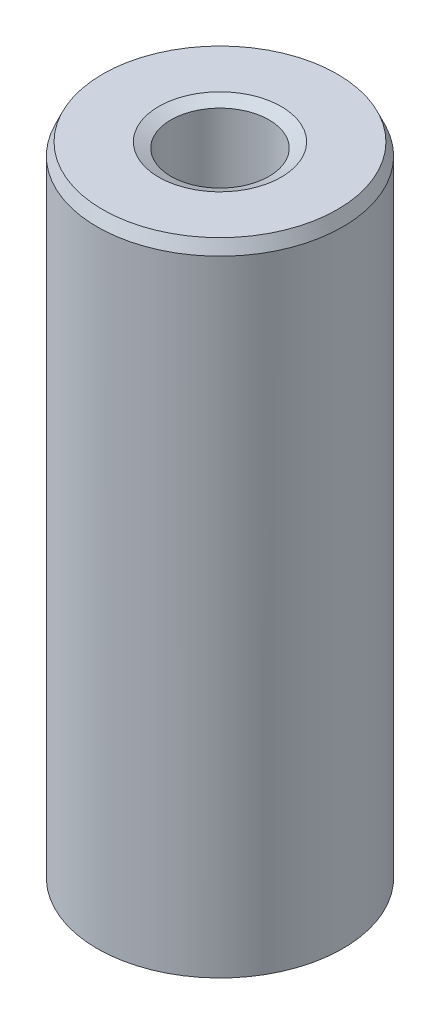
ISO-10303-21;
HEADER;
FILE_DESCRIPTION(('STEP AP214'),'2;1');
FILE_NAME('part.step','',(''),(''),'','','');
FILE_SCHEMA(('AUTOMOTIVE_DESIGN { 1 0 10303 214 1 1 1 1 }'));
ENDSEC;
DATA;
#1=APPLICATION_CONTEXT('core data for automotive mechanical design processes');
#2=APPLICATION_PROTOCOL_DEFINITION('international standard','automotive_design',2000,#1);
#3=PRODUCT_CONTEXT('',#1,'mechanical');
#4=PRODUCT('Part','Part','',(#3));
#5=PRODUCT_RELATED_PRODUCT_CATEGORY('part','',(#4));
#6=PRODUCT_DEFINITION_FORMATION('','',#4);
#7=PRODUCT_DEFINITION_CONTEXT('part definition',#1,'design');
#8=PRODUCT_DEFINITION('design','',#6,#7);
#9=PRODUCT_DEFINITION_SHAPE('','',#8);
#10=(LENGTH_UNIT() NAMED_UNIT(*) SI_UNIT(.MILLI.,.METRE.));
#11=(NAMED_UNIT(*) PLANE_ANGLE_UNIT() SI_UNIT($,.RADIAN.));
#12=(NAMED_UNIT(*) SI_UNIT($,.STERADIAN.) SOLID_ANGLE_UNIT());
#13=UNCERTAINTY_MEASURE_WITH_UNIT(LENGTH_MEASURE(1.E-05),#10,'distance_accuracy_value','');
#14=(GEOMETRIC_REPRESENTATION_CONTEXT(3) GLOBAL_UNCERTAINTY_ASSIGNED_CONTEXT((#13)) GLOBAL_UNIT_ASSIGNED_CONTEXT((#10,
#11,#12)) REPRESENTATION_CONTEXT('',''));
#15=CARTESIAN_POINT('',(0.,0.,0.));
#16=DIRECTION('',(0.,0.,1.));
#17=DIRECTION('',(1.,0.,0.));
#18=AXIS2_PLACEMENT_3D('',#15,#16,#17);
#19=CARTESIAN_POINT('',(0.,39.2579038623078,0.));
#20=DIRECTION('',(0.,-1.,0.));
#21=DIRECTION('',(0.,0.,-1.));
#22=AXIS2_PLACEMENT_3D('',#19,#20,#21);
#23=CYLINDRICAL_SURFACE('',#22,7.5);
#24=CARTESIAN_POINT('',(0.,0.331876313613769,0.));
#25=DIRECTION('',(0.,1.,0.));
#26=DIRECTION('',(0.,0.,1.));
#27=AXIS2_PLACEMENT_3D('',#24,#25,#26);
#28=CIRCLE('',#27,7.5);
#29=CARTESIAN_POINT('',(0.,0.331876313613762,-7.5));
#30=VERTEX_POINT('',#29);
#31=EDGE_CURVE('E10',#30,#30,#28,.T.);
#32=CARTESIAN_POINT('',(0.,38.5085401836551,0.));
#33=DIRECTION('',(0.,1.,0.));
#34=DIRECTION('',(0.,0.,1.));
#35=AXIS2_PLACEMENT_3D('',#32,#33,#34);
#36=CIRCLE('',#35,7.5);
#37=CARTESIAN_POINT('',(0.,38.5085401836551,-7.5));
#38=VERTEX_POINT('',#37);
#39=EDGE_CURVE('E50',#38,#38,#36,.F.);
#40=CARTESIAN_POINT('',(0.,0.331876313613762,-7.5));
#41=CARTESIAN_POINT('',(0.,0.729549895593359,-7.5));
#42=CARTESIAN_POINT('',(0.,1.12722347757296,-7.5));
#43=CARTESIAN_POINT('',(0.,1.92257064153215,-7.5));
#44=CARTESIAN_POINT('',(0.,2.32024422351175,-7.5));
#45=CARTESIAN_POINT('',(0.,3.11559138747095,-7.5));
#46=CARTESIAN_POINT('',(0.,3.51326496945054,-7.5));
#47=CARTESIAN_POINT('',(0.,4.30861213340974,-7.5));
#48=CARTESIAN_POINT('',(0.,4.70628571538934,-7.5));
#49=CARTESIAN_POINT('',(0.,5.50163287934853,-7.5));
#50=CARTESIAN_POINT('',(0.,5.89930646132813,-7.5));
#51=CARTESIAN_POINT('',(0.,6.69465362528732,-7.5));
#52=CARTESIAN_POINT('',(0.,7.09232720726692,-7.5));
#53=CARTESIAN_POINT('',(0.,7.88767437122612,-7.5));
#54=CARTESIAN_POINT('',(0.,8.28534795320571,-7.5));
#55=CARTESIAN_POINT('',(0.,9.08069511716491,-7.5));
#56=CARTESIAN_POINT('',(0.,9.4783686991445,-7.5));
#57=CARTESIAN_POINT('',(0.,10.2737158631037,-7.5));
#58=CARTESIAN_POINT('',(0.,10.6713894450833,-7.5));
#59=CARTESIAN_POINT('',(0.,11.4667366090425,-7.5));
#60=CARTESIAN_POINT('',(0.,11.8644101910221,-7.5));
#61=CARTESIAN_POINT('',(0.,12.6597573549813,-7.5));
#62=CARTESIAN_POINT('',(0.,13.0574309369609,-7.5));
#63=CARTESIAN_POINT('',(0.,13.8527781009201,-7.5));
#64=CARTESIAN_POINT('',(0.,14.2504516828997,-7.5));
#65=CARTESIAN_POINT('',(0.,15.0457988468589,-7.5));
#66=CARTESIAN_POINT('',(0.,15.4434724288385,-7.5));
#67=CARTESIAN_POINT('',(0.,16.2388195927977,-7.5));
#68=CARTESIAN_POINT('',(0.,16.6364931747773,-7.5));
#69=CARTESIAN_POINT('',(0.,17.4318403387365,-7.5));
#70=CARTESIAN_POINT('',(0.,17.829513920716,-7.5));
#71=CARTESIAN_POINT('',(0.,18.6248610846752,-7.5));
#72=CARTESIAN_POINT('',(0.,19.0225346666548,-7.5));
#73=CARTESIAN_POINT('',(0.,19.817881830614,-7.5));
#74=CARTESIAN_POINT('',(0.,20.2155554125936,-7.5));
#75=CARTESIAN_POINT('',(0.,21.0109025765528,-7.5));
#76=CARTESIAN_POINT('',(0.,21.4085761585324,-7.5));
#77=CARTESIAN_POINT('',(0.,22.2039233224916,-7.5));
#78=CARTESIAN_POINT('',(0.,22.6015969044712,-7.5));
#79=CARTESIAN_POINT('',(0.,23.3969440684304,-7.5));
#80=CARTESIAN_POINT('',(0.,23.79461765041,-7.5));
#81=CARTESIAN_POINT('',(0.,24.5899648143692,-7.5));
#82=CARTESIAN_POINT('',(0.,24.9876383963488,-7.5));
#83=CARTESIAN_POINT('',(0.,25.782985560308,-7.5));
#84=CARTESIAN_POINT('',(0.,26.1806591422876,-7.5));
#85=CARTESIAN_POINT('',(0.,26.9760063062468,-7.5));
#86=CARTESIAN_POINT('',(0.,27.3736798882264,-7.5));
#87=CARTESIAN_POINT('',(0.,28.1690270521856,-7.5));
#88=CARTESIAN_POINT('',(0.,28.5667006341652,-7.5));
#89=CARTESIAN_POINT('',(0.,29.3620477981244,-7.5));
#90=CARTESIAN_POINT('',(0.,29.759721380104,-7.5));
#91=CARTESIAN_POINT('',(0.,30.5550685440632,-7.5));
#92=CARTESIAN_POINT('',(0.,30.9527421260428,-7.5));
#93=CARTESIAN_POINT('',(0.,31.748089290002,-7.5));
#94=CARTESIAN_POINT('',(0.,32.1457628719816,-7.5));
#95=CARTESIAN_POINT('',(0.,32.9411100359408,-7.5));
#96=CARTESIAN_POINT('',(0.,33.3387836179203,-7.5));
#97=CARTESIAN_POINT('',(0.,34.1341307818795,-7.5));
#98=CARTESIAN_POINT('',(0.,34.5318043638591,-7.5));
#99=CARTESIAN_POINT('',(0.,35.3271515278183,-7.5));
#100=CARTESIAN_POINT('',(0.,35.7248251097979,-7.5));
#101=CARTESIAN_POINT('',(0.,36.5201722737571,-7.5));
#102=CARTESIAN_POINT('',(0.,36.9178458557367,-7.5));
#103=CARTESIAN_POINT('',(0.,37.7131930196959,-7.5));
#104=CARTESIAN_POINT('',(0.,38.1108666016755,-7.5));
#105=CARTESIAN_POINT('',(0.,38.5085401836551,-7.5));
#106=B_SPLINE_CURVE_WITH_KNOTS('',3,(#40,#41,#42,#43,#44,#45,#46,#47,#48,#49,#50,#51,#52,#53,
#54,#55,#56,#57,#58,#59,#60,#61,#62,#63,#64,#65,#66,#67,#68,#69,#70,#71,#72,#73,#74,#75,#76,#77,
#78,#79,#80,#81,#82,#83,#84,#85,#86,#87,#88,#89,#90,#91,#92,#93,#94,#95,#96,#97,#98,#99,#100,
#101,#102,#103,#104,#105),.UNSPECIFIED.,.F.,.F.,(4,2,2,2,2,2,2,2,2,2,2,2,2,2,2,2,2,2,2,2,2,2,2,
2,2,2,2,2,2,2,2,2,4),(0.,1.19302074593879,2.38604149187759,3.57906223781638,4.77208298375517,
5.96510372969396,7.15812447563276,8.35114522157155,9.54416596751034,10.7371867134491,
11.9302074593879,13.1232282053267,14.3162489512655,15.5092696972043,16.7022904431431,
17.8953111890819,19.0883319350207,20.2813526809595,21.4743734268983,22.6673941728371,
23.8604149187758,25.0534356647146,26.2464564106534,27.4394771565922,28.632497902531,
29.8255186484698,31.0185393944086,32.2115601403474,33.4045808862862,34.597601632225,
35.7906223781638,36.9836431241026,38.1766638700414),.UNSPECIFIED.);
#107=EDGE_CURVE('BSEAM39',#30,#38,#106,.T.);
#108=ORIENTED_EDGE('',*,*,#31,.T.);
#109=ORIENTED_EDGE('',*,*,#39,.T.);
#110=ORIENTED_EDGE('',*,*,#107,.T.);
#111=ORIENTED_EDGE('',*,*,#107,.F.);
#112=EDGE_LOOP('',(#108,#110,#109,#111));
#113=FACE_BOUND('',#112,.T.);
#114=ADVANCED_FACE('F39',(#113),#23,.T.);
#115=CARTESIAN_POINT('',(0.,39.2579038623078,0.));
#116=DIRECTION('',(0.,1.,0.));
#117=DIRECTION('',(0.,0.,1.));
#118=AXIS2_PLACEMENT_3D('',#115,#116,#117);
#119=PLANE('',#118);
#120=CARTESIAN_POINT('',(0.,39.2579038623078,0.));
#121=DIRECTION('',(0.,1.,0.));
#122=DIRECTION('',(0.,0.,1.));
#123=AXIS2_PLACEMENT_3D('',#120,#121,#122);
#124=CIRCLE('',#123,3.74300796448758);
#125=CARTESIAN_POINT('',(0.,39.2579038623078,3.74300796448758));
#126=VERTEX_POINT('',#125);
#127=EDGE_CURVE('E58',#126,#126,#124,.F.);
#128=ORIENTED_EDGE('',*,*,#127,.T.);
#129=EDGE_LOOP('',(#128));
#130=FACE_BOUND('',#129,.T.);
#131=CARTESIAN_POINT('',(0.,39.2579038623078,0.));
#132=DIRECTION('',(0.,1.,0.));
#133=DIRECTION('',(0.,0.,1.));
#134=AXIS2_PLACEMENT_3D('',#131,#132,#133);
#135=CIRCLE('',#134,7.16812368638628);
#136=CARTESIAN_POINT('',(0.,39.2579038623078,7.16812368638628));
#137=VERTEX_POINT('',#136);
#138=EDGE_CURVE('E61',#137,#137,#135,.T.);
#139=ORIENTED_EDGE('',*,*,#138,.T.);
#140=EDGE_LOOP('',(#139));
#141=FACE_BOUND('',#140,.T.);
#142=ADVANCED_FACE('F88',(#130,#141),#119,.T.);
#143=CARTESIAN_POINT('',(0.,0.,0.));
#144=DIRECTION('',(0.,1.,0.));
#145=DIRECTION('',(0.,0.,1.));
#146=AXIS2_PLACEMENT_3D('',#143,#144,#145);
#147=PLANE('',#146);
#148=CARTESIAN_POINT('',(0.,0.,0.));
#149=DIRECTION('',(0.,1.,0.));
#150=DIRECTION('',(0.,0.,1.));
#151=AXIS2_PLACEMENT_3D('',#148,#149,#150);
#152=CIRCLE('',#151,3.32552059944857);
#153=CARTESIAN_POINT('',(0.,0.,3.32552059944857));
#154=VERTEX_POINT('',#153);
#155=EDGE_CURVE('E51',#154,#154,#152,.T.);
#156=ORIENTED_EDGE('',*,*,#155,.T.);
#157=EDGE_LOOP('',(#156));
#158=FACE_BOUND('',#157,.T.);
#159=CARTESIAN_POINT('',(0.,0.,0.));
#160=DIRECTION('',(0.,1.,0.));
#161=DIRECTION('',(0.,0.,1.));
#162=AXIS2_PLACEMENT_3D('',#159,#160,#161);
#163=CIRCLE('',#162,6.75063632134722);
#164=CARTESIAN_POINT('',(0.,0.,6.75063632134722));
#165=VERTEX_POINT('',#164);
#166=EDGE_CURVE('E54',#165,#165,#163,.F.);
#167=ORIENTED_EDGE('',*,*,#166,.T.);
#168=EDGE_LOOP('',(#167));
#169=FACE_BOUND('',#168,.T.);
#170=ADVANCED_FACE('F83',(#158,#169),#147,.F.);
#171=CARTESIAN_POINT('',(0.,39.2579038623078,0.));
#172=DIRECTION('',(0.,-1.,0.));
#173=DIRECTION('',(0.,0.,-1.));
#174=AXIS2_PLACEMENT_3D('',#171,#172,#173);
#175=CYLINDRICAL_SURFACE('',#174,2.99364428583483);
#176=CARTESIAN_POINT('',(0.,38.926027548694,0.));
#177=DIRECTION('',(0.,1.,0.));
#178=DIRECTION('',(0.,0.,1.));
#179=AXIS2_PLACEMENT_3D('',#176,#177,#178);
#180=CIRCLE('',#179,2.99364428583483);
#181=CARTESIAN_POINT('',(0.,38.926027548694,-2.99364428583483));
#182=VERTEX_POINT('',#181);
#183=EDGE_CURVE('E67',#182,#182,#180,.T.);
#184=CARTESIAN_POINT('',(0.,0.749363678652734,0.));
#185=DIRECTION('',(0.,1.,0.));
#186=DIRECTION('',(0.,0.,1.));
#187=AXIS2_PLACEMENT_3D('',#184,#185,#186);
#188=CIRCLE('',#187,2.99364428583483);
#189=CARTESIAN_POINT('',(0.,0.749363678652727,-2.99364428583483));
#190=VERTEX_POINT('',#189);
#191=EDGE_CURVE('E69',#190,#190,#188,.F.);
#192=CARTESIAN_POINT('',(0.,38.926027548694,-2.99364428583483));
#193=CARTESIAN_POINT('',(0.,38.5283539667144,-2.99364428583483));
#194=CARTESIAN_POINT('',(0.,38.1306803847348,-2.99364428583483));
#195=CARTESIAN_POINT('',(0.,37.3353332207756,-2.99364428583483));
#196=CARTESIAN_POINT('',(0.,36.937659638796,-2.99364428583483));
#197=CARTESIAN_POINT('',(0.,36.1423124748368,-2.99364428583483));
#198=CARTESIAN_POINT('',(0.,35.7446388928572,-2.99364428583483));
#199=CARTESIAN_POINT('',(0.,34.9492917288981,-2.99364428583483));
#200=CARTESIAN_POINT('',(0.,34.5516181469185,-2.99364428583483));
#201=CARTESIAN_POINT('',(0.,33.7562709829593,-2.99364428583483));
#202=CARTESIAN_POINT('',(0.,33.3585974009797,-2.99364428583483));
#203=CARTESIAN_POINT('',(0.,32.5632502370205,-2.99364428583483));
#204=CARTESIAN_POINT('',(0.,32.1655766550409,-2.99364428583483));
#205=CARTESIAN_POINT('',(0.,31.3702294910817,-2.99364428583483));
#206=CARTESIAN_POINT('',(0.,30.9725559091021,-2.99364428583483));
#207=CARTESIAN_POINT('',(0.,30.1772087451429,-2.99364428583483));
#208=CARTESIAN_POINT('',(0.,29.7795351631633,-2.99364428583483));
#209=CARTESIAN_POINT('',(0.,28.9841879992041,-2.99364428583483));
#210=CARTESIAN_POINT('',(0.,28.5865144172245,-2.99364428583483));
#211=CARTESIAN_POINT('',(0.,27.7911672532653,-2.99364428583483));
#212=CARTESIAN_POINT('',(0.,27.3934936712857,-2.99364428583483));
#213=CARTESIAN_POINT('',(0.,26.5981465073265,-2.99364428583483));
#214=CARTESIAN_POINT('',(0.,26.2004729253469,-2.99364428583483));
#215=CARTESIAN_POINT('',(0.,25.4051257613877,-2.99364428583483));
#216=CARTESIAN_POINT('',(0.,25.0074521794081,-2.99364428583483));
#217=CARTESIAN_POINT('',(0.,24.2121050154489,-2.99364428583483));
#218=CARTESIAN_POINT('',(0.,23.8144314334693,-2.99364428583483));
#219=CARTESIAN_POINT('',(0.,23.0190842695101,-2.99364428583483));
#220=CARTESIAN_POINT('',(0.,22.6214106875306,-2.99364428583483));
#221=CARTESIAN_POINT('',(0.,21.8260635235714,-2.99364428583483));
#222=CARTESIAN_POINT('',(0.,21.4283899415918,-2.99364428583483));
#223=CARTESIAN_POINT('',(0.,20.6330427776326,-2.99364428583483));
#224=CARTESIAN_POINT('',(0.,20.235369195653,-2.99364428583483));
#225=CARTESIAN_POINT('',(0.,19.4400220316938,-2.99364428583483));
#226=CARTESIAN_POINT('',(0.,19.0423484497142,-2.99364428583483));
#227=CARTESIAN_POINT('',(0.,18.247001285755,-2.99364428583483));
#228=CARTESIAN_POINT('',(0.,17.8493277037754,-2.99364428583483));
#229=CARTESIAN_POINT('',(0.,17.0539805398162,-2.99364428583483));
#230=CARTESIAN_POINT('',(0.,16.6563069578366,-2.99364428583483));
#231=CARTESIAN_POINT('',(0.,15.8609597938774,-2.99364428583483));
#232=CARTESIAN_POINT('',(0.,15.4632862118978,-2.99364428583483));
#233=CARTESIAN_POINT('',(0.,14.6679390479386,-2.99364428583483));
#234=CARTESIAN_POINT('',(0.,14.270265465959,-2.99364428583483));
#235=CARTESIAN_POINT('',(0.,13.4749183019998,-2.99364428583483));
#236=CARTESIAN_POINT('',(0.,13.0772447200202,-2.99364428583483));
#237=CARTESIAN_POINT('',(0.,12.281897556061,-2.99364428583483));
#238=CARTESIAN_POINT('',(0.,11.8842239740814,-2.99364428583483));
#239=CARTESIAN_POINT('',(0.,11.0888768101222,-2.99364428583483));
#240=CARTESIAN_POINT('',(0.,10.6912032281426,-2.99364428583483));
#241=CARTESIAN_POINT('',(0.,9.89585606418345,-2.99364428583483));
#242=CARTESIAN_POINT('',(0.,9.49818248220386,-2.99364428583483));
#243=CARTESIAN_POINT('',(0.,8.70283531824466,-2.99364428583483));
#244=CARTESIAN_POINT('',(0.,8.30516173626507,-2.99364428583483));
#245=CARTESIAN_POINT('',(0.,7.50981457230587,-2.99364428583483));
#246=CARTESIAN_POINT('',(0.,7.11214099032628,-2.99364428583483));
#247=CARTESIAN_POINT('',(0.,6.31679382636708,-2.99364428583483));
#248=CARTESIAN_POINT('',(0.,5.91912024438749,-2.99364428583483));
#249=CARTESIAN_POINT('',(0.,5.12377308042829,-2.99364428583483));
#250=CARTESIAN_POINT('',(0.,4.7260994984487,-2.99364428583483));
#251=CARTESIAN_POINT('',(0.,3.9307523344895,-2.99364428583483));
#252=CARTESIAN_POINT('',(0.,3.5330787525099,-2.99364428583483));
#253=CARTESIAN_POINT('',(0.,2.73773158855071,-2.99364428583483));
#254=CARTESIAN_POINT('',(0.,2.34005800657112,-2.99364428583483));
#255=CARTESIAN_POINT('',(0.,1.54471084261192,-2.99364428583483));
#256=CARTESIAN_POINT('',(0.,1.14703726063232,-2.99364428583483));
#257=CARTESIAN_POINT('',(0.,0.749363678652727,-2.99364428583483));
#258=B_SPLINE_CURVE_WITH_KNOTS('',3,(#192,#193,#194,#195,#196,#197,#198,#199,#200,#201,#202,
#203,#204,#205,#206,#207,#208,#209,#210,#211,#212,#213,#214,#215,#216,#217,#218,#219,#220,#221,
#222,#223,#224,#225,#226,#227,#228,#229,#230,#231,#232,#233,#234,#235,#236,#237,#238,#239,#240,
#241,#242,#243,#244,#245,#246,#247,#248,#249,#250,#251,#252,#253,#254,#255,#256,#257),
.UNSPECIFIED.,.F.,.F.,(4,2,2,2,2,2,2,2,2,2,2,2,2,2,2,2,2,2,2,2,2,2,2,2,2,2,2,2,2,2,2,2,4),(0.,
1.19302074593879,2.38604149187758,3.57906223781636,4.77208298375516,5.96510372969395,
7.15812447563274,8.35114522157153,9.54416596751032,10.7371867134491,11.9302074593879,
13.1232282053267,14.3162489512655,15.5092696972043,16.7022904431431,17.8953111890819,
19.0883319350206,20.2813526809594,21.4743734268982,22.667394172837,23.8604149187758,
25.0534356647146,26.2464564106534,27.4394771565922,28.632497902531,29.8255186484698,
31.0185393944085,32.2115601403473,33.4045808862861,34.5976016322249,35.7906223781637,
36.9836431241025,38.1766638700413),.UNSPECIFIED.);
#259=EDGE_CURVE('BSEAM71',#182,#190,#258,.T.);
#260=ORIENTED_EDGE('',*,*,#183,.T.);
#261=ORIENTED_EDGE('',*,*,#191,.T.);
#262=ORIENTED_EDGE('',*,*,#259,.T.);
#263=ORIENTED_EDGE('',*,*,#259,.F.);
#264=EDGE_LOOP('',(#260,#262,#261,#263));
#265=FACE_BOUND('',#264,.T.);
#266=ADVANCED_FACE('F71',(#265),#175,.F.);
#267=CARTESIAN_POINT('',(0.,38.926027548694,0.));
#268=DIRECTION('',(0.,1.,0.));
#269=DIRECTION('',(0.,0.,1.));
#270=AXIS2_PLACEMENT_3D('',#267,#268,#269);
#271=CONICAL_SURFACE('',#270,2.99364428583483,1.15388123609396);
#272=ORIENTED_EDGE('',*,*,#127,.F.);
#273=EDGE_LOOP('',(#272));
#274=FACE_BOUND('',#273,.T.);
#275=ORIENTED_EDGE('',*,*,#183,.F.);
#276=EDGE_LOOP('',(#275));
#277=FACE_BOUND('',#276,.T.);
#278=ADVANCED_FACE('F77',(#274,#277),#271,.F.);
#279=CARTESIAN_POINT('',(0.,0.,0.));
#280=DIRECTION('',(0.,-1.,0.));
#281=DIRECTION('',(0.,0.,-1.));
#282=AXIS2_PLACEMENT_3D('',#279,#280,#281);
#283=CONICAL_SURFACE('',#282,3.32552059944857,0.416915090700921);
#284=ORIENTED_EDGE('',*,*,#191,.F.);
#285=EDGE_LOOP('',(#284));
#286=FACE_BOUND('',#285,.T.);
#287=ORIENTED_EDGE('',*,*,#155,.F.);
#288=EDGE_LOOP('',(#287));
#289=FACE_BOUND('',#288,.T.);
#290=ADVANCED_FACE('F73',(#286,#289),#283,.F.);
#291=CARTESIAN_POINT('',(0.,0.331876313613769,0.));
#292=DIRECTION('',(0.,1.,0.));
#293=DIRECTION('',(0.,0.,1.));
#294=AXIS2_PLACEMENT_3D('',#291,#292,#293);
#295=CONICAL_SURFACE('',#294,7.5,1.15388123609397);
#296=ORIENTED_EDGE('',*,*,#166,.F.);
#297=EDGE_LOOP('',(#296));
#298=FACE_BOUND('',#297,.T.);
#299=ORIENTED_EDGE('',*,*,#31,.F.);
#300=EDGE_LOOP('',(#299));
#301=FACE_BOUND('',#300,.T.);
#302=ADVANCED_FACE('F76',(#298,#301),#295,.T.);
#303=CARTESIAN_POINT('',(0.,39.2579038623078,0.));
#304=DIRECTION('',(0.,-1.,0.));
#305=DIRECTION('',(0.,0.,-1.));
#306=AXIS2_PLACEMENT_3D('',#303,#304,#305);
#307=CONICAL_SURFACE('',#306,7.16812368638628,0.416915090700926);
#308=ORIENTED_EDGE('',*,*,#39,.F.);
#309=EDGE_LOOP('',(#308));
#310=FACE_BOUND('',#309,.T.);
#311=ORIENTED_EDGE('',*,*,#138,.F.);
#312=EDGE_LOOP('',(#311));
#313=FACE_BOUND('',#312,.T.);
#314=ADVANCED_FACE('F45',(#310,#313),#307,.T.);
#315=CLOSED_SHELL('',(#114,#142,#170,#266,#278,#290,#302,#314));
#316=MANIFOLD_SOLID_BREP('B2',#315);
#317=ADVANCED_BREP_SHAPE_REPRESENTATION('',(#18,#316),#14);
#318=SHAPE_DEFINITION_REPRESENTATION(#9,#317);
ENDSEC;
END-ISO-10303-21;
